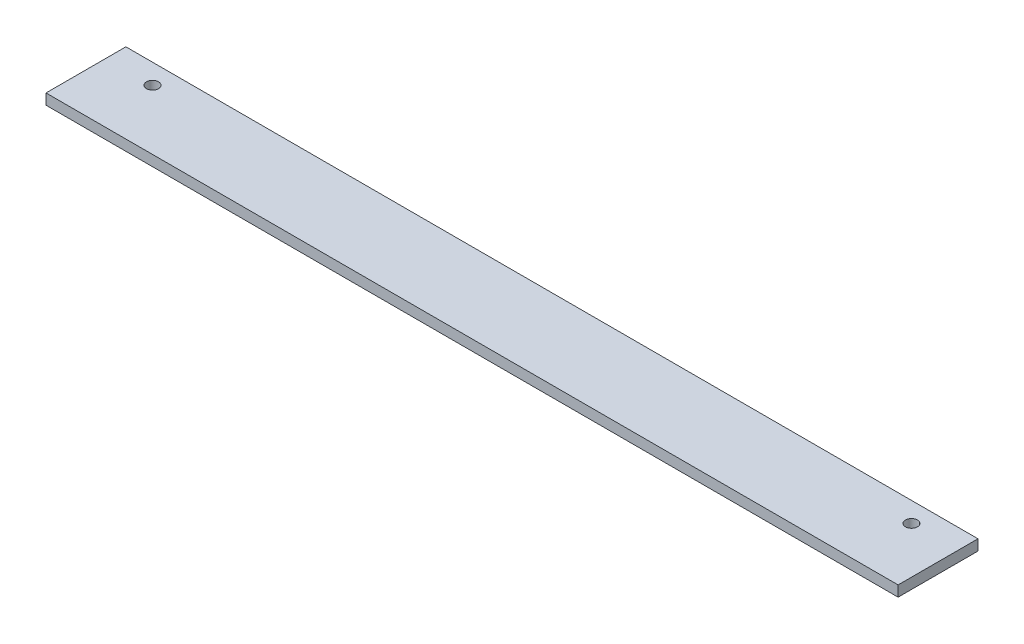
ISO-10303-21;
HEADER;
FILE_DESCRIPTION(('STEP AP214'),'2;1');
FILE_NAME('part.step','',(''),(''),'','','');
FILE_SCHEMA(('AUTOMOTIVE_DESIGN { 1 0 10303 214 1 1 1 1 }'));
ENDSEC;
DATA;
#1=APPLICATION_CONTEXT('core data for automotive mechanical design processes');
#2=APPLICATION_PROTOCOL_DEFINITION('international standard','automotive_design',2000,#1);
#3=PRODUCT_CONTEXT('',#1,'mechanical');
#4=PRODUCT('Part','Part','',(#3));
#5=PRODUCT_RELATED_PRODUCT_CATEGORY('part','',(#4));
#6=PRODUCT_DEFINITION_FORMATION('','',#4);
#7=PRODUCT_DEFINITION_CONTEXT('part definition',#1,'design');
#8=PRODUCT_DEFINITION('design','',#6,#7);
#9=PRODUCT_DEFINITION_SHAPE('','',#8);
#10=(LENGTH_UNIT() NAMED_UNIT(*) SI_UNIT(.MILLI.,.METRE.));
#11=(NAMED_UNIT(*) PLANE_ANGLE_UNIT() SI_UNIT($,.RADIAN.));
#12=(NAMED_UNIT(*) SI_UNIT($,.STERADIAN.) SOLID_ANGLE_UNIT());
#13=UNCERTAINTY_MEASURE_WITH_UNIT(LENGTH_MEASURE(1.E-05),#10,'distance_accuracy_value','');
#14=(GEOMETRIC_REPRESENTATION_CONTEXT(3) GLOBAL_UNCERTAINTY_ASSIGNED_CONTEXT((#13)) GLOBAL_UNIT_ASSIGNED_CONTEXT((#10,
#11,#12)) REPRESENTATION_CONTEXT('',''));
#15=CARTESIAN_POINT('',(0.,0.,0.));
#16=DIRECTION('',(0.,0.,1.));
#17=DIRECTION('',(1.,0.,0.));
#18=AXIS2_PLACEMENT_3D('',#15,#16,#17);
#19=CARTESIAN_POINT('',(320.,-2.,-15.));
#20=DIRECTION('',(0.,0.,1.));
#21=DIRECTION('',(1.,0.,0.));
#22=AXIS2_PLACEMENT_3D('',#19,#20,#21);
#23=PLANE('',#22);
#24=DIRECTION('',(0.,1.,0.));
#25=VECTOR('',#24,1.);
#26=CARTESIAN_POINT('',(0.,-2.,-15.));
#27=LINE('',#26,#25);
#28=CARTESIAN_POINT('',(0.,-2.,-15.));
#29=VERTEX_POINT('',#28);
#30=CARTESIAN_POINT('',(0.,2.,-15.));
#31=VERTEX_POINT('',#30);
#32=EDGE_CURVE('E98',#29,#31,#27,.T.);
#33=ORIENTED_EDGE('',*,*,#32,.T.);
#34=DIRECTION('',(-1.,0.,0.));
#35=VECTOR('',#34,1.);
#36=CARTESIAN_POINT('',(320.,2.,-15.));
#37=LINE('',#36,#35);
#38=CARTESIAN_POINT('',(320.,2.,-15.));
#39=VERTEX_POINT('',#38);
#40=EDGE_CURVE('E11',#39,#31,#37,.T.);
#41=ORIENTED_EDGE('',*,*,#40,.F.);
#42=DIRECTION('',(0.,1.,0.));
#43=VECTOR('',#42,1.);
#44=CARTESIAN_POINT('',(320.,-2.,-15.));
#45=LINE('',#44,#43);
#46=CARTESIAN_POINT('',(320.,-2.,-15.));
#47=VERTEX_POINT('',#46);
#48=EDGE_CURVE('E86',#47,#39,#45,.T.);
#49=ORIENTED_EDGE('',*,*,#48,.F.);
#50=DIRECTION('',(-1.,0.,0.));
#51=VECTOR('',#50,1.);
#52=CARTESIAN_POINT('',(320.,-2.,-15.));
#53=LINE('',#52,#51);
#54=EDGE_CURVE('E94',#47,#29,#53,.T.);
#55=ORIENTED_EDGE('',*,*,#54,.T.);
#56=EDGE_LOOP('',(#33,#41,#49,#55));
#57=FACE_BOUND('',#56,.T.);
#58=ADVANCED_FACE('F35',(#57),#23,.F.);
#59=CARTESIAN_POINT('',(320.,2.,15.));
#60=DIRECTION('',(0.,-1.,0.));
#61=DIRECTION('',(0.,0.,-1.));
#62=AXIS2_PLACEMENT_3D('',#59,#60,#61);
#63=PLANE('',#62);
#64=CARTESIAN_POINT('',(17.5,2.,-7.5));
#65=DIRECTION('',(0.,1.,0.));
#66=DIRECTION('',(0.,0.,1.));
#67=AXIS2_PLACEMENT_3D('',#64,#65,#66);
#68=CIRCLE('',#67,2.25);
#69=CARTESIAN_POINT('',(17.5,2.,-5.25));
#70=VERTEX_POINT('',#69);
#71=EDGE_CURVE('E118',#70,#70,#68,.T.);
#72=ORIENTED_EDGE('',*,*,#71,.F.);
#73=EDGE_LOOP('',(#72));
#74=FACE_BOUND('',#73,.T.);
#75=CARTESIAN_POINT('',(302.5,2.,-7.5));
#76=DIRECTION('',(0.,1.,0.));
#77=DIRECTION('',(0.,0.,1.));
#78=AXIS2_PLACEMENT_3D('',#75,#76,#77);
#79=CIRCLE('',#78,2.24999999999995);
#80=CARTESIAN_POINT('',(302.5,2.,-5.25000000000005));
#81=VERTEX_POINT('',#80);
#82=EDGE_CURVE('E112',#81,#81,#79,.T.);
#83=ORIENTED_EDGE('',*,*,#82,.F.);
#84=EDGE_LOOP('',(#83));
#85=FACE_BOUND('',#84,.T.);
#86=DIRECTION('',(0.,0.,1.));
#87=VECTOR('',#86,1.);
#88=CARTESIAN_POINT('',(0.,2.,15.));
#89=LINE('',#88,#87);
#90=CARTESIAN_POINT('',(0.,2.,15.));
#91=VERTEX_POINT('',#90);
#92=EDGE_CURVE('E90',#31,#91,#89,.T.);
#93=ORIENTED_EDGE('',*,*,#92,.T.);
#94=DIRECTION('',(-1.,0.,0.));
#95=VECTOR('',#94,1.);
#96=CARTESIAN_POINT('',(320.,2.,15.));
#97=LINE('',#96,#95);
#98=CARTESIAN_POINT('',(320.,2.,15.));
#99=VERTEX_POINT('',#98);
#100=EDGE_CURVE('E43',#99,#91,#97,.T.);
#101=ORIENTED_EDGE('',*,*,#100,.F.);
#102=DIRECTION('',(0.,0.,1.));
#103=VECTOR('',#102,1.);
#104=CARTESIAN_POINT('',(320.,2.,15.));
#105=LINE('',#104,#103);
#106=EDGE_CURVE('E81',#39,#99,#105,.T.);
#107=ORIENTED_EDGE('',*,*,#106,.F.);
#108=ORIENTED_EDGE('',*,*,#40,.T.);
#109=EDGE_LOOP('',(#93,#101,#107,#108));
#110=FACE_BOUND('',#109,.T.);
#111=ADVANCED_FACE('F89',(#74,#85,#110),#63,.F.);
#112=CARTESIAN_POINT('',(320.,-2.,15.));
#113=DIRECTION('',(0.,0.,-1.));
#114=DIRECTION('',(-1.,0.,0.));
#115=AXIS2_PLACEMENT_3D('',#112,#113,#114);
#116=PLANE('',#115);
#117=DIRECTION('',(0.,-1.,0.));
#118=VECTOR('',#117,1.);
#119=CARTESIAN_POINT('',(0.,-2.,15.));
#120=LINE('',#119,#118);
#121=CARTESIAN_POINT('',(0.,-2.,15.));
#122=VERTEX_POINT('',#121);
#123=EDGE_CURVE('E68',#91,#122,#120,.T.);
#124=ORIENTED_EDGE('',*,*,#123,.T.);
#125=DIRECTION('',(-1.,0.,0.));
#126=VECTOR('',#125,1.);
#127=CARTESIAN_POINT('',(320.,-2.,15.));
#128=LINE('',#127,#126);
#129=CARTESIAN_POINT('',(320.,-2.,15.));
#130=VERTEX_POINT('',#129);
#131=EDGE_CURVE('E91',#130,#122,#128,.T.);
#132=ORIENTED_EDGE('',*,*,#131,.F.);
#133=DIRECTION('',(0.,-1.,0.));
#134=VECTOR('',#133,1.);
#135=CARTESIAN_POINT('',(320.,-2.,15.));
#136=LINE('',#135,#134);
#137=EDGE_CURVE('E84',#99,#130,#136,.T.);
#138=ORIENTED_EDGE('',*,*,#137,.F.);
#139=ORIENTED_EDGE('',*,*,#100,.T.);
#140=EDGE_LOOP('',(#124,#132,#138,#139));
#141=FACE_BOUND('',#140,.T.);
#142=ADVANCED_FACE('F92',(#141),#116,.F.);
#143=CARTESIAN_POINT('',(320.,-2.,15.));
#144=DIRECTION('',(0.,1.,0.));
#145=DIRECTION('',(0.,0.,1.));
#146=AXIS2_PLACEMENT_3D('',#143,#144,#145);
#147=PLANE('',#146);
#148=CARTESIAN_POINT('',(17.5,-2.,-7.5));
#149=DIRECTION('',(0.,1.,0.));
#150=DIRECTION('',(0.,0.,1.));
#151=AXIS2_PLACEMENT_3D('',#148,#149,#150);
#152=CIRCLE('',#151,2.25);
#153=CARTESIAN_POINT('',(17.5,-2.,-5.25));
#154=VERTEX_POINT('',#153);
#155=EDGE_CURVE('E101',#154,#154,#152,.T.);
#156=ORIENTED_EDGE('',*,*,#155,.T.);
#157=EDGE_LOOP('',(#156));
#158=FACE_BOUND('',#157,.T.);
#159=CARTESIAN_POINT('',(302.5,-2.,-7.5));
#160=DIRECTION('',(0.,1.,0.));
#161=DIRECTION('',(0.,0.,1.));
#162=AXIS2_PLACEMENT_3D('',#159,#160,#161);
#163=CIRCLE('',#162,2.24999999999995);
#164=CARTESIAN_POINT('',(302.5,-2.,-5.25000000000005));
#165=VERTEX_POINT('',#164);
#166=EDGE_CURVE('E115',#165,#165,#163,.T.);
#167=ORIENTED_EDGE('',*,*,#166,.T.);
#168=EDGE_LOOP('',(#167));
#169=FACE_BOUND('',#168,.T.);
#170=DIRECTION('',(0.,0.,-1.));
#171=VECTOR('',#170,1.);
#172=CARTESIAN_POINT('',(0.,-2.,15.));
#173=LINE('',#172,#171);
#174=EDGE_CURVE('E74',#122,#29,#173,.T.);
#175=ORIENTED_EDGE('',*,*,#174,.T.);
#176=ORIENTED_EDGE('',*,*,#54,.F.);
#177=DIRECTION('',(0.,0.,-1.));
#178=VECTOR('',#177,1.);
#179=CARTESIAN_POINT('',(320.,-2.,15.));
#180=LINE('',#179,#178);
#181=EDGE_CURVE('E51',#130,#47,#180,.T.);
#182=ORIENTED_EDGE('',*,*,#181,.F.);
#183=ORIENTED_EDGE('',*,*,#131,.T.);
#184=EDGE_LOOP('',(#175,#176,#182,#183));
#185=FACE_BOUND('',#184,.T.);
#186=ADVANCED_FACE('F106',(#158,#169,#185),#147,.F.);
#187=CARTESIAN_POINT('',(320.,0.,0.));
#188=DIRECTION('',(-1.,0.,0.));
#189=DIRECTION('',(0.,0.,1.));
#190=AXIS2_PLACEMENT_3D('',#187,#188,#189);
#191=PLANE('',#190);
#192=ORIENTED_EDGE('',*,*,#48,.T.);
#193=ORIENTED_EDGE('',*,*,#106,.T.);
#194=ORIENTED_EDGE('',*,*,#137,.T.);
#195=ORIENTED_EDGE('',*,*,#181,.T.);
#196=EDGE_LOOP('',(#192,#193,#194,#195));
#197=FACE_BOUND('',#196,.T.);
#198=ADVANCED_FACE('F82',(#197),#191,.F.);
#199=CARTESIAN_POINT('',(0.,0.,0.));
#200=DIRECTION('',(-1.,0.,0.));
#201=DIRECTION('',(0.,0.,1.));
#202=AXIS2_PLACEMENT_3D('',#199,#200,#201);
#203=PLANE('',#202);
#204=ORIENTED_EDGE('',*,*,#32,.F.);
#205=ORIENTED_EDGE('',*,*,#174,.F.);
#206=ORIENTED_EDGE('',*,*,#123,.F.);
#207=ORIENTED_EDGE('',*,*,#92,.F.);
#208=EDGE_LOOP('',(#204,#205,#206,#207));
#209=FACE_BOUND('',#208,.T.);
#210=ADVANCED_FACE('F109',(#209),#203,.T.);
#211=CARTESIAN_POINT('',(302.5,-2.,-7.5));
#212=DIRECTION('',(0.,1.,0.));
#213=DIRECTION('',(0.,0.,1.));
#214=AXIS2_PLACEMENT_3D('',#211,#212,#213);
#215=CYLINDRICAL_SURFACE('',#214,2.24999999999995);
#216=ORIENTED_EDGE('',*,*,#166,.F.);
#217=EDGE_LOOP('',(#216));
#218=FACE_BOUND('',#217,.T.);
#219=ORIENTED_EDGE('',*,*,#82,.T.);
#220=EDGE_LOOP('',(#219));
#221=FACE_BOUND('',#220,.T.);
#222=ADVANCED_FACE('F129',(#218,#221),#215,.F.);
#223=CARTESIAN_POINT('',(17.5,-2.,-7.5));
#224=DIRECTION('',(0.,1.,0.));
#225=DIRECTION('',(0.,0.,1.));
#226=AXIS2_PLACEMENT_3D('',#223,#224,#225);
#227=CYLINDRICAL_SURFACE('',#226,2.25);
#228=ORIENTED_EDGE('',*,*,#155,.F.);
#229=EDGE_LOOP('',(#228));
#230=FACE_BOUND('',#229,.T.);
#231=ORIENTED_EDGE('',*,*,#71,.T.);
#232=EDGE_LOOP('',(#231));
#233=FACE_BOUND('',#232,.T.);
#234=ADVANCED_FACE('F126',(#230,#233),#227,.F.);
#235=CLOSED_SHELL('',(#58,#111,#142,#186,#198,#210,#222,#234));
#236=MANIFOLD_SOLID_BREP('B2',#235);
#237=ADVANCED_BREP_SHAPE_REPRESENTATION('',(#18,#236),#14);
#238=SHAPE_DEFINITION_REPRESENTATION(#9,#237);
ENDSEC;
END-ISO-10303-21;
